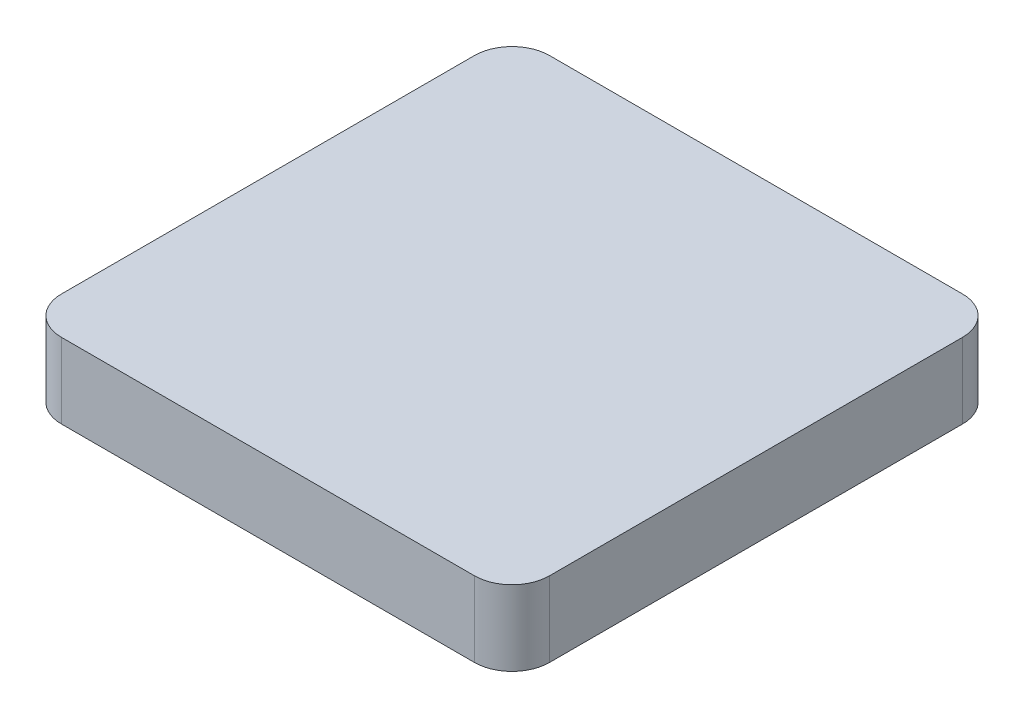
ISO-10303-21;
HEADER;
FILE_DESCRIPTION(('STEP AP214'),'2;1');
FILE_NAME('part.step','',(''),(''),'','','');
FILE_SCHEMA(('AUTOMOTIVE_DESIGN { 1 0 10303 214 1 1 1 1 }'));
ENDSEC;
DATA;
#1=APPLICATION_CONTEXT('core data for automotive mechanical design processes');
#2=APPLICATION_PROTOCOL_DEFINITION('international standard','automotive_design',2000,#1);
#3=PRODUCT_CONTEXT('',#1,'mechanical');
#4=PRODUCT('Part','Part','',(#3));
#5=PRODUCT_RELATED_PRODUCT_CATEGORY('part','',(#4));
#6=PRODUCT_DEFINITION_FORMATION('','',#4);
#7=PRODUCT_DEFINITION_CONTEXT('part definition',#1,'design');
#8=PRODUCT_DEFINITION('design','',#6,#7);
#9=PRODUCT_DEFINITION_SHAPE('','',#8);
#10=(LENGTH_UNIT() NAMED_UNIT(*) SI_UNIT(.MILLI.,.METRE.));
#11=(NAMED_UNIT(*) PLANE_ANGLE_UNIT() SI_UNIT($,.RADIAN.));
#12=(NAMED_UNIT(*) SI_UNIT($,.STERADIAN.) SOLID_ANGLE_UNIT());
#13=UNCERTAINTY_MEASURE_WITH_UNIT(LENGTH_MEASURE(1.E-05),#10,'distance_accuracy_value','');
#14=(GEOMETRIC_REPRESENTATION_CONTEXT(3) GLOBAL_UNCERTAINTY_ASSIGNED_CONTEXT((#13)) GLOBAL_UNIT_ASSIGNED_CONTEXT((#10,
#11,#12)) REPRESENTATION_CONTEXT('',''));
#15=CARTESIAN_POINT('',(0.,0.,0.));
#16=DIRECTION('',(0.,0.,1.));
#17=DIRECTION('',(1.,0.,0.));
#18=AXIS2_PLACEMENT_3D('',#15,#16,#17);
#19=CARTESIAN_POINT('',(5.5,2.,5.5));
#20=DIRECTION('',(0.,-1.,0.));
#21=DIRECTION('',(0.,0.,-1.));
#22=AXIS2_PLACEMENT_3D('',#19,#20,#21);
#23=CYLINDRICAL_SURFACE('',#22,1.);
#24=CARTESIAN_POINT('',(5.5,0.,5.5));
#25=DIRECTION('',(0.,1.,0.));
#26=DIRECTION('',(0.,0.,-1.));
#27=AXIS2_PLACEMENT_3D('',#24,#25,#26);
#28=CIRCLE('',#27,1.);
#29=CARTESIAN_POINT('',(5.49999999999999,0.,6.5));
#30=VERTEX_POINT('',#29);
#31=CARTESIAN_POINT('',(6.5,0.,5.49999999999999));
#32=VERTEX_POINT('',#31);
#33=EDGE_CURVE('E130',#30,#32,#28,.T.);
#34=ORIENTED_EDGE('',*,*,#33,.T.);
#35=DIRECTION('',(0.,-1.,0.));
#36=VECTOR('',#35,1.);
#37=CARTESIAN_POINT('',(6.5,2.,5.49999999999999));
#38=LINE('',#37,#36);
#39=CARTESIAN_POINT('',(6.5,2.,5.49999999999999));
#40=VERTEX_POINT('',#39);
#41=EDGE_CURVE('E11',#40,#32,#38,.T.);
#42=ORIENTED_EDGE('',*,*,#41,.F.);
#43=CARTESIAN_POINT('',(5.5,2.,5.5));
#44=DIRECTION('',(0.,1.,0.));
#45=DIRECTION('',(0.,0.,-1.));
#46=AXIS2_PLACEMENT_3D('',#43,#44,#45);
#47=CIRCLE('',#46,1.);
#48=CARTESIAN_POINT('',(5.49999999999999,2.,6.5));
#49=VERTEX_POINT('',#48);
#50=EDGE_CURVE('E144',#49,#40,#47,.T.);
#51=ORIENTED_EDGE('',*,*,#50,.F.);
#52=DIRECTION('',(0.,-1.,0.));
#53=VECTOR('',#52,1.);
#54=CARTESIAN_POINT('',(5.49999999999999,2.,6.5));
#55=LINE('',#54,#53);
#56=EDGE_CURVE('E126',#49,#30,#55,.T.);
#57=ORIENTED_EDGE('',*,*,#56,.T.);
#58=EDGE_LOOP('',(#34,#42,#51,#57));
#59=FACE_BOUND('',#58,.T.);
#60=ADVANCED_FACE('F34',(#59),#23,.T.);
#61=CARTESIAN_POINT('',(6.5,2.,5.49999999999999));
#62=DIRECTION('',(-1.,0.,0.));
#63=DIRECTION('',(0.,0.,1.));
#64=AXIS2_PLACEMENT_3D('',#61,#62,#63);
#65=PLANE('',#64);
#66=DIRECTION('',(0.,0.,-1.));
#67=VECTOR('',#66,1.);
#68=CARTESIAN_POINT('',(6.5,0.,5.49999999999999));
#69=LINE('',#68,#67);
#70=CARTESIAN_POINT('',(6.5,0.,-5.49999999999999));
#71=VERTEX_POINT('',#70);
#72=EDGE_CURVE('E133',#32,#71,#69,.T.);
#73=ORIENTED_EDGE('',*,*,#72,.T.);
#74=DIRECTION('',(0.,-1.,0.));
#75=VECTOR('',#74,1.);
#76=CARTESIAN_POINT('',(6.5,2.,-5.49999999999999));
#77=LINE('',#76,#75);
#78=CARTESIAN_POINT('',(6.5,2.,-5.49999999999999));
#79=VERTEX_POINT('',#78);
#80=EDGE_CURVE('E42',#79,#71,#77,.T.);
#81=ORIENTED_EDGE('',*,*,#80,.F.);
#82=DIRECTION('',(0.,0.,-1.));
#83=VECTOR('',#82,1.);
#84=CARTESIAN_POINT('',(6.5,2.,5.49999999999999));
#85=LINE('',#84,#83);
#86=EDGE_CURVE('E93',#40,#79,#85,.T.);
#87=ORIENTED_EDGE('',*,*,#86,.F.);
#88=ORIENTED_EDGE('',*,*,#41,.T.);
#89=EDGE_LOOP('',(#73,#81,#87,#88));
#90=FACE_BOUND('',#89,.T.);
#91=ADVANCED_FACE('F179',(#90),#65,.F.);
#92=CARTESIAN_POINT('',(5.5,2.,-5.5));
#93=DIRECTION('',(0.,-1.,0.));
#94=DIRECTION('',(0.,0.,-1.));
#95=AXIS2_PLACEMENT_3D('',#92,#93,#94);
#96=CYLINDRICAL_SURFACE('',#95,1.);
#97=CARTESIAN_POINT('',(5.5,0.,-5.5));
#98=DIRECTION('',(0.,1.,0.));
#99=DIRECTION('',(0.,0.,1.));
#100=AXIS2_PLACEMENT_3D('',#97,#98,#99);
#101=CIRCLE('',#100,1.);
#102=CARTESIAN_POINT('',(5.49999999999999,0.,-6.5));
#103=VERTEX_POINT('',#102);
#104=EDGE_CURVE('E135',#71,#103,#101,.T.);
#105=ORIENTED_EDGE('',*,*,#104,.T.);
#106=DIRECTION('',(0.,-1.,0.));
#107=VECTOR('',#106,1.);
#108=CARTESIAN_POINT('',(5.49999999999999,2.,-6.5));
#109=LINE('',#108,#107);
#110=CARTESIAN_POINT('',(5.49999999999999,2.,-6.5));
#111=VERTEX_POINT('',#110);
#112=EDGE_CURVE('E151',#111,#103,#109,.T.);
#113=ORIENTED_EDGE('',*,*,#112,.F.);
#114=CARTESIAN_POINT('',(5.5,2.,-5.5));
#115=DIRECTION('',(0.,1.,0.));
#116=DIRECTION('',(0.,0.,1.));
#117=AXIS2_PLACEMENT_3D('',#114,#115,#116);
#118=CIRCLE('',#117,1.);
#119=EDGE_CURVE('E159',#79,#111,#118,.T.);
#120=ORIENTED_EDGE('',*,*,#119,.F.);
#121=ORIENTED_EDGE('',*,*,#80,.T.);
#122=EDGE_LOOP('',(#105,#113,#120,#121));
#123=FACE_BOUND('',#122,.T.);
#124=ADVANCED_FACE('F157',(#123),#96,.T.);
#125=CARTESIAN_POINT('',(5.49999999999999,2.,-6.5));
#126=DIRECTION('',(0.,0.,1.));
#127=DIRECTION('',(1.,0.,0.));
#128=AXIS2_PLACEMENT_3D('',#125,#126,#127);
#129=PLANE('',#128);
#130=DIRECTION('',(-1.,0.,0.));
#131=VECTOR('',#130,1.);
#132=CARTESIAN_POINT('',(5.49999999999999,0.,-6.5));
#133=LINE('',#132,#131);
#134=CARTESIAN_POINT('',(-5.49999999999999,0.,-6.5));
#135=VERTEX_POINT('',#134);
#136=EDGE_CURVE('E137',#103,#135,#133,.T.);
#137=ORIENTED_EDGE('',*,*,#136,.T.);
#138=DIRECTION('',(0.,-1.,0.));
#139=VECTOR('',#138,1.);
#140=CARTESIAN_POINT('',(-5.49999999999999,2.,-6.5));
#141=LINE('',#140,#139);
#142=CARTESIAN_POINT('',(-5.49999999999999,2.,-6.5));
#143=VERTEX_POINT('',#142);
#144=EDGE_CURVE('E148',#143,#135,#141,.T.);
#145=ORIENTED_EDGE('',*,*,#144,.F.);
#146=DIRECTION('',(-1.,0.,0.));
#147=VECTOR('',#146,1.);
#148=CARTESIAN_POINT('',(5.49999999999999,2.,-6.5));
#149=LINE('',#148,#147);
#150=EDGE_CURVE('E171',#111,#143,#149,.T.);
#151=ORIENTED_EDGE('',*,*,#150,.F.);
#152=ORIENTED_EDGE('',*,*,#112,.T.);
#153=EDGE_LOOP('',(#137,#145,#151,#152));
#154=FACE_BOUND('',#153,.T.);
#155=ADVANCED_FACE('F167',(#154),#129,.F.);
#156=CARTESIAN_POINT('',(-5.5,2.,-5.5));
#157=DIRECTION('',(0.,-1.,0.));
#158=DIRECTION('',(0.,0.,-1.));
#159=AXIS2_PLACEMENT_3D('',#156,#157,#158);
#160=CYLINDRICAL_SURFACE('',#159,1.);
#161=CARTESIAN_POINT('',(-5.5,0.,-5.5));
#162=DIRECTION('',(0.,1.,0.));
#163=DIRECTION('',(0.,0.,1.));
#164=AXIS2_PLACEMENT_3D('',#161,#162,#163);
#165=CIRCLE('',#164,1.);
#166=CARTESIAN_POINT('',(-6.5,0.,-5.49999999999999));
#167=VERTEX_POINT('',#166);
#168=EDGE_CURVE('E139',#135,#167,#165,.T.);
#169=ORIENTED_EDGE('',*,*,#168,.T.);
#170=DIRECTION('',(0.,-1.,0.));
#171=VECTOR('',#170,1.);
#172=CARTESIAN_POINT('',(-6.5,2.,-5.49999999999999));
#173=LINE('',#172,#171);
#174=CARTESIAN_POINT('',(-6.5,2.,-5.49999999999999));
#175=VERTEX_POINT('',#174);
#176=EDGE_CURVE('E121',#175,#167,#173,.T.);
#177=ORIENTED_EDGE('',*,*,#176,.F.);
#178=CARTESIAN_POINT('',(-5.5,2.,-5.5));
#179=DIRECTION('',(0.,1.,0.));
#180=DIRECTION('',(0.,0.,1.));
#181=AXIS2_PLACEMENT_3D('',#178,#179,#180);
#182=CIRCLE('',#181,1.);
#183=EDGE_CURVE('E112',#143,#175,#182,.T.);
#184=ORIENTED_EDGE('',*,*,#183,.F.);
#185=ORIENTED_EDGE('',*,*,#144,.T.);
#186=EDGE_LOOP('',(#169,#177,#184,#185));
#187=FACE_BOUND('',#186,.T.);
#188=ADVANCED_FACE('F170',(#187),#160,.T.);
#189=CARTESIAN_POINT('',(-6.5,2.,5.49999999999999));
#190=DIRECTION('',(1.,0.,0.));
#191=DIRECTION('',(0.,0.,-1.));
#192=AXIS2_PLACEMENT_3D('',#189,#190,#191);
#193=PLANE('',#192);
#194=DIRECTION('',(0.,0.,1.));
#195=VECTOR('',#194,1.);
#196=CARTESIAN_POINT('',(-6.5,0.,5.49999999999999));
#197=LINE('',#196,#195);
#198=CARTESIAN_POINT('',(-6.5,0.,5.49999999999999));
#199=VERTEX_POINT('',#198);
#200=EDGE_CURVE('E120',#167,#199,#197,.T.);
#201=ORIENTED_EDGE('',*,*,#200,.T.);
#202=DIRECTION('',(0.,-1.,0.));
#203=VECTOR('',#202,1.);
#204=CARTESIAN_POINT('',(-6.5,2.,5.49999999999999));
#205=LINE('',#204,#203);
#206=CARTESIAN_POINT('',(-6.5,2.,5.49999999999999));
#207=VERTEX_POINT('',#206);
#208=EDGE_CURVE('E117',#207,#199,#205,.T.);
#209=ORIENTED_EDGE('',*,*,#208,.F.);
#210=DIRECTION('',(0.,0.,1.));
#211=VECTOR('',#210,1.);
#212=CARTESIAN_POINT('',(-6.5,2.,5.49999999999999));
#213=LINE('',#212,#211);
#214=EDGE_CURVE('E106',#175,#207,#213,.T.);
#215=ORIENTED_EDGE('',*,*,#214,.F.);
#216=ORIENTED_EDGE('',*,*,#176,.T.);
#217=EDGE_LOOP('',(#201,#209,#215,#216));
#218=FACE_BOUND('',#217,.T.);
#219=ADVANCED_FACE('F118',(#218),#193,.F.);
#220=CARTESIAN_POINT('',(-5.5,2.,5.5));
#221=DIRECTION('',(0.,-1.,0.));
#222=DIRECTION('',(0.,0.,-1.));
#223=AXIS2_PLACEMENT_3D('',#220,#221,#222);
#224=CYLINDRICAL_SURFACE('',#223,1.);
#225=CARTESIAN_POINT('',(-5.5,0.,5.5));
#226=DIRECTION('',(0.,1.,0.));
#227=DIRECTION('',(0.,0.,-1.));
#228=AXIS2_PLACEMENT_3D('',#225,#226,#227);
#229=CIRCLE('',#228,1.);
#230=CARTESIAN_POINT('',(-5.49999999999999,0.,6.5));
#231=VERTEX_POINT('',#230);
#232=EDGE_CURVE('E79',#199,#231,#229,.T.);
#233=ORIENTED_EDGE('',*,*,#232,.T.);
#234=DIRECTION('',(0.,-1.,0.));
#235=VECTOR('',#234,1.);
#236=CARTESIAN_POINT('',(-5.49999999999999,2.,6.5));
#237=LINE('',#236,#235);
#238=CARTESIAN_POINT('',(-5.49999999999999,2.,6.5));
#239=VERTEX_POINT('',#238);
#240=EDGE_CURVE('E122',#239,#231,#237,.T.);
#241=ORIENTED_EDGE('',*,*,#240,.F.);
#242=CARTESIAN_POINT('',(-5.5,2.,5.5));
#243=DIRECTION('',(0.,1.,0.));
#244=DIRECTION('',(0.,0.,-1.));
#245=AXIS2_PLACEMENT_3D('',#242,#243,#244);
#246=CIRCLE('',#245,1.);
#247=EDGE_CURVE('E110',#207,#239,#246,.T.);
#248=ORIENTED_EDGE('',*,*,#247,.F.);
#249=ORIENTED_EDGE('',*,*,#208,.T.);
#250=EDGE_LOOP('',(#233,#241,#248,#249));
#251=FACE_BOUND('',#250,.T.);
#252=ADVANCED_FACE('F124',(#251),#224,.T.);
#253=CARTESIAN_POINT('',(5.49999999999999,2.,6.5));
#254=DIRECTION('',(0.,0.,-1.));
#255=DIRECTION('',(-1.,0.,0.));
#256=AXIS2_PLACEMENT_3D('',#253,#254,#255);
#257=PLANE('',#256);
#258=DIRECTION('',(1.,0.,0.));
#259=VECTOR('',#258,1.);
#260=CARTESIAN_POINT('',(5.49999999999999,0.,6.5));
#261=LINE('',#260,#259);
#262=EDGE_CURVE('E85',#231,#30,#261,.T.);
#263=ORIENTED_EDGE('',*,*,#262,.T.);
#264=ORIENTED_EDGE('',*,*,#56,.F.);
#265=DIRECTION('',(1.,0.,0.));
#266=VECTOR('',#265,1.);
#267=CARTESIAN_POINT('',(5.49999999999999,2.,6.5));
#268=LINE('',#267,#266);
#269=EDGE_CURVE('E50',#239,#49,#268,.T.);
#270=ORIENTED_EDGE('',*,*,#269,.F.);
#271=ORIENTED_EDGE('',*,*,#240,.T.);
#272=EDGE_LOOP('',(#263,#264,#270,#271));
#273=FACE_BOUND('',#272,.T.);
#274=ADVANCED_FACE('F195',(#273),#257,.F.);
#275=CARTESIAN_POINT('',(5.5,2.,5.5));
#276=DIRECTION('',(0.,-1.,0.));
#277=DIRECTION('',(0.,0.,-1.));
#278=AXIS2_PLACEMENT_3D('',#275,#276,#277);
#279=PLANE('',#278);
#280=ORIENTED_EDGE('',*,*,#50,.T.);
#281=ORIENTED_EDGE('',*,*,#86,.T.);
#282=ORIENTED_EDGE('',*,*,#119,.T.);
#283=ORIENTED_EDGE('',*,*,#150,.T.);
#284=ORIENTED_EDGE('',*,*,#183,.T.);
#285=ORIENTED_EDGE('',*,*,#214,.T.);
#286=ORIENTED_EDGE('',*,*,#247,.T.);
#287=ORIENTED_EDGE('',*,*,#269,.T.);
#288=EDGE_LOOP('',(#280,#281,#282,#283,#284,#285,#286,#287));
#289=FACE_BOUND('',#288,.T.);
#290=ADVANCED_FACE('F108',(#289),#279,.F.);
#291=CARTESIAN_POINT('',(5.5,0.,5.5));
#292=DIRECTION('',(0.,-1.,0.));
#293=DIRECTION('',(0.,0.,-1.));
#294=AXIS2_PLACEMENT_3D('',#291,#292,#293);
#295=PLANE('',#294);
#296=ORIENTED_EDGE('',*,*,#33,.F.);
#297=ORIENTED_EDGE('',*,*,#262,.F.);
#298=ORIENTED_EDGE('',*,*,#232,.F.);
#299=ORIENTED_EDGE('',*,*,#200,.F.);
#300=ORIENTED_EDGE('',*,*,#168,.F.);
#301=ORIENTED_EDGE('',*,*,#136,.F.);
#302=ORIENTED_EDGE('',*,*,#104,.F.);
#303=ORIENTED_EDGE('',*,*,#72,.F.);
#304=EDGE_LOOP('',(#296,#297,#298,#299,#300,#301,#302,#303));
#305=FACE_BOUND('',#304,.T.);
#306=ADVANCED_FACE('F163',(#305),#295,.T.);
#307=CLOSED_SHELL('',(#60,#91,#124,#155,#188,#219,#252,#274,#290,#306));
#308=MANIFOLD_SOLID_BREP('B2',#307);
#309=ADVANCED_BREP_SHAPE_REPRESENTATION('',(#18,#308),#14);
#310=SHAPE_DEFINITION_REPRESENTATION(#9,#309);
ENDSEC;
END-ISO-10303-21;
